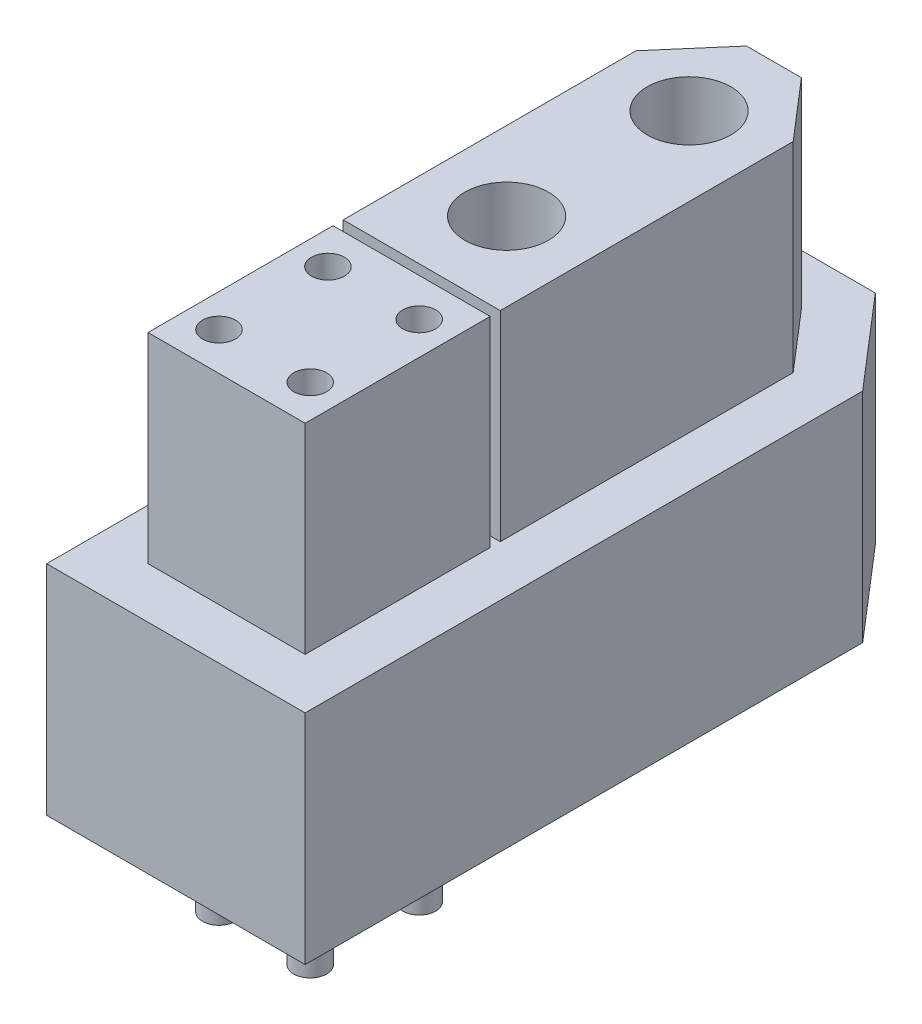
ISO-10303-21;
HEADER;
FILE_DESCRIPTION(('STEP AP214'),'2;1');
FILE_NAME('part.step','',(''),(''),'','','');
FILE_SCHEMA(('AUTOMOTIVE_DESIGN { 1 0 10303 214 1 1 1 1 }'));
ENDSEC;
DATA;
#1=APPLICATION_CONTEXT('core data for automotive mechanical design processes');
#2=APPLICATION_PROTOCOL_DEFINITION('international standard','automotive_design',2000,#1);
#3=PRODUCT_CONTEXT('',#1,'mechanical');
#4=PRODUCT('Part','Part','',(#3));
#5=PRODUCT_RELATED_PRODUCT_CATEGORY('part','',(#4));
#6=PRODUCT_DEFINITION_FORMATION('','',#4);
#7=PRODUCT_DEFINITION_CONTEXT('part definition',#1,'design');
#8=PRODUCT_DEFINITION('design','',#6,#7);
#9=PRODUCT_DEFINITION_SHAPE('','',#8);
#10=(LENGTH_UNIT() NAMED_UNIT(*) SI_UNIT(.MILLI.,.METRE.));
#11=(NAMED_UNIT(*) PLANE_ANGLE_UNIT() SI_UNIT($,.RADIAN.));
#12=(NAMED_UNIT(*) SI_UNIT($,.STERADIAN.) SOLID_ANGLE_UNIT());
#13=UNCERTAINTY_MEASURE_WITH_UNIT(LENGTH_MEASURE(1.E-05),#10,'distance_accuracy_value','');
#14=(GEOMETRIC_REPRESENTATION_CONTEXT(3) GLOBAL_UNCERTAINTY_ASSIGNED_CONTEXT((#13)) GLOBAL_UNIT_ASSIGNED_CONTEXT((#10,
#11,#12)) REPRESENTATION_CONTEXT('',''));
#15=CARTESIAN_POINT('',(0.,0.,0.));
#16=DIRECTION('',(0.,0.,1.));
#17=DIRECTION('',(1.,0.,0.));
#18=AXIS2_PLACEMENT_3D('',#15,#16,#17);
#19=CARTESIAN_POINT('',(0.,8.6,0.));
#20=DIRECTION('',(0.,0.,-1.));
#21=DIRECTION('',(-1.,0.,0.));
#22=AXIS2_PLACEMENT_3D('',#19,#20,#21);
#23=PLANE('',#22);
#24=DIRECTION('',(1.,0.,0.));
#25=VECTOR('',#24,1.);
#26=CARTESIAN_POINT('',(0.,0.,0.));
#27=LINE('',#26,#25);
#28=CARTESIAN_POINT('',(0.,0.,0.));
#29=VERTEX_POINT('',#28);
#30=CARTESIAN_POINT('',(10.2,0.,0.));
#31=VERTEX_POINT('',#30);
#32=EDGE_CURVE('E268',#29,#31,#27,.T.);
#33=ORIENTED_EDGE('',*,*,#32,.T.);
#34=DIRECTION('',(0.,-1.,0.));
#35=VECTOR('',#34,1.);
#36=CARTESIAN_POINT('',(10.2,8.6,0.));
#37=LINE('',#36,#35);
#38=CARTESIAN_POINT('',(10.2,8.6,0.));
#39=VERTEX_POINT('',#38);
#40=EDGE_CURVE('E326',#39,#31,#37,.T.);
#41=ORIENTED_EDGE('',*,*,#40,.F.);
#42=DIRECTION('',(1.,0.,0.));
#43=VECTOR('',#42,1.);
#44=CARTESIAN_POINT('',(0.,8.6,0.));
#45=LINE('',#44,#43);
#46=CARTESIAN_POINT('',(0.,8.6,0.));
#47=VERTEX_POINT('',#46);
#48=EDGE_CURVE('E269',#47,#39,#45,.T.);
#49=ORIENTED_EDGE('',*,*,#48,.F.);
#50=DIRECTION('',(0.,-1.,0.));
#51=VECTOR('',#50,1.);
#52=CARTESIAN_POINT('',(0.,8.6,0.));
#53=LINE('',#52,#51);
#54=EDGE_CURVE('E289',#47,#29,#53,.T.);
#55=ORIENTED_EDGE('',*,*,#54,.T.);
#56=EDGE_LOOP('',(#33,#41,#49,#55));
#57=FACE_BOUND('',#56,.T.);
#58=ADVANCED_FACE('F39',(#57),#23,.F.);
#59=CARTESIAN_POINT('',(10.2,8.6,0.));
#60=DIRECTION('',(-1.,0.,0.));
#61=DIRECTION('',(0.,0.,1.));
#62=AXIS2_PLACEMENT_3D('',#59,#60,#61);
#63=PLANE('',#62);
#64=DIRECTION('',(0.,0.,-1.));
#65=VECTOR('',#64,1.);
#66=CARTESIAN_POINT('',(10.2,0.,0.));
#67=LINE('',#66,#65);
#68=CARTESIAN_POINT('',(10.2,0.,-22.));
#69=VERTEX_POINT('',#68);
#70=EDGE_CURVE('E293',#31,#69,#67,.T.);
#71=ORIENTED_EDGE('',*,*,#70,.T.);
#72=DIRECTION('',(0.,-1.,0.));
#73=VECTOR('',#72,1.);
#74=CARTESIAN_POINT('',(10.2,8.6,-22.));
#75=LINE('',#74,#73);
#76=CARTESIAN_POINT('',(10.2,8.6,-22.));
#77=VERTEX_POINT('',#76);
#78=EDGE_CURVE('E322',#77,#69,#75,.T.);
#79=ORIENTED_EDGE('',*,*,#78,.F.);
#80=DIRECTION('',(0.,0.,-1.));
#81=VECTOR('',#80,1.);
#82=CARTESIAN_POINT('',(10.2,8.6,0.));
#83=LINE('',#82,#81);
#84=EDGE_CURVE('E273',#39,#77,#83,.T.);
#85=ORIENTED_EDGE('',*,*,#84,.F.);
#86=ORIENTED_EDGE('',*,*,#40,.T.);
#87=EDGE_LOOP('',(#71,#79,#85,#86));
#88=FACE_BOUND('',#87,.T.);
#89=ADVANCED_FACE('F441',(#88),#63,.F.);
#90=CARTESIAN_POINT('',(10.2,8.6,-22.));
#91=DIRECTION('',(-0.757768802353406,0.,0.652523135359877));
#92=DIRECTION('',(0.652523135359877,0.,0.757768802353406));
#93=AXIS2_PLACEMENT_3D('',#90,#91,#92);
#94=PLANE('',#93);
#95=DIRECTION('',(-0.652523135359877,0.,-0.757768802353406));
#96=VECTOR('',#95,1.);
#97=CARTESIAN_POINT('',(10.2,0.,-22.));
#98=LINE('',#97,#96);
#99=CARTESIAN_POINT('',(7.1,0.,-25.6));
#100=VERTEX_POINT('',#99);
#101=EDGE_CURVE('E296',#69,#100,#98,.T.);
#102=ORIENTED_EDGE('',*,*,#101,.T.);
#103=DIRECTION('',(0.,-1.,0.));
#104=VECTOR('',#103,1.);
#105=CARTESIAN_POINT('',(7.1,8.6,-25.6));
#106=LINE('',#105,#104);
#107=CARTESIAN_POINT('',(7.1,8.6,-25.6));
#108=VERTEX_POINT('',#107);
#109=EDGE_CURVE('E318',#108,#100,#106,.T.);
#110=ORIENTED_EDGE('',*,*,#109,.F.);
#111=DIRECTION('',(-0.652523135359877,0.,-0.757768802353406));
#112=VECTOR('',#111,1.);
#113=CARTESIAN_POINT('',(10.2,8.6,-22.));
#114=LINE('',#113,#112);
#115=EDGE_CURVE('E277',#77,#108,#114,.T.);
#116=ORIENTED_EDGE('',*,*,#115,.F.);
#117=ORIENTED_EDGE('',*,*,#78,.T.);
#118=EDGE_LOOP('',(#102,#110,#116,#117));
#119=FACE_BOUND('',#118,.T.);
#120=ADVANCED_FACE('F446',(#119),#94,.F.);
#121=CARTESIAN_POINT('',(3.1,8.6,-25.6));
#122=DIRECTION('',(0.,0.,1.));
#123=DIRECTION('',(1.,0.,0.));
#124=AXIS2_PLACEMENT_3D('',#121,#122,#123);
#125=PLANE('',#124);
#126=DIRECTION('',(-1.,0.,0.));
#127=VECTOR('',#126,1.);
#128=CARTESIAN_POINT('',(3.1,0.,-25.6));
#129=LINE('',#128,#127);
#130=CARTESIAN_POINT('',(3.1,0.,-25.6));
#131=VERTEX_POINT('',#130);
#132=EDGE_CURVE('E299',#100,#131,#129,.T.);
#133=ORIENTED_EDGE('',*,*,#132,.T.);
#134=DIRECTION('',(0.,-1.,0.));
#135=VECTOR('',#134,1.);
#136=CARTESIAN_POINT('',(3.1,8.6,-25.6));
#137=LINE('',#136,#135);
#138=CARTESIAN_POINT('',(3.1,8.6,-25.6));
#139=VERTEX_POINT('',#138);
#140=EDGE_CURVE('E314',#139,#131,#137,.T.);
#141=ORIENTED_EDGE('',*,*,#140,.F.);
#142=DIRECTION('',(-1.,0.,0.));
#143=VECTOR('',#142,1.);
#144=CARTESIAN_POINT('',(3.1,8.6,-25.6));
#145=LINE('',#144,#143);
#146=EDGE_CURVE('E280',#108,#139,#145,.T.);
#147=ORIENTED_EDGE('',*,*,#146,.F.);
#148=ORIENTED_EDGE('',*,*,#109,.T.);
#149=EDGE_LOOP('',(#133,#141,#147,#148));
#150=FACE_BOUND('',#149,.T.);
#151=ADVANCED_FACE('F470',(#150),#125,.F.);
#152=CARTESIAN_POINT('',(0.,8.6,-22.));
#153=DIRECTION('',(0.757768802353406,0.,0.652523135359877));
#154=DIRECTION('',(0.652523135359877,0.,-0.757768802353406));
#155=AXIS2_PLACEMENT_3D('',#152,#153,#154);
#156=PLANE('',#155);
#157=DIRECTION('',(-0.652523135359877,0.,0.757768802353406));
#158=VECTOR('',#157,1.);
#159=CARTESIAN_POINT('',(0.,0.,-22.));
#160=LINE('',#159,#158);
#161=CARTESIAN_POINT('',(0.,0.,-22.));
#162=VERTEX_POINT('',#161);
#163=EDGE_CURVE('E302',#131,#162,#160,.T.);
#164=ORIENTED_EDGE('',*,*,#163,.T.);
#165=DIRECTION('',(0.,-1.,0.));
#166=VECTOR('',#165,1.);
#167=CARTESIAN_POINT('',(0.,8.6,-22.));
#168=LINE('',#167,#166);
#169=CARTESIAN_POINT('',(0.,8.6,-22.));
#170=VERTEX_POINT('',#169);
#171=EDGE_CURVE('E310',#170,#162,#168,.T.);
#172=ORIENTED_EDGE('',*,*,#171,.F.);
#173=DIRECTION('',(-0.652523135359877,0.,0.757768802353406));
#174=VECTOR('',#173,1.);
#175=CARTESIAN_POINT('',(0.,8.6,-22.));
#176=LINE('',#175,#174);
#177=EDGE_CURVE('E283',#139,#170,#176,.T.);
#178=ORIENTED_EDGE('',*,*,#177,.F.);
#179=ORIENTED_EDGE('',*,*,#140,.T.);
#180=EDGE_LOOP('',(#164,#172,#178,#179));
#181=FACE_BOUND('',#180,.T.);
#182=ADVANCED_FACE('F467',(#181),#156,.F.);
#183=CARTESIAN_POINT('',(0.,8.6,0.));
#184=DIRECTION('',(1.,0.,0.));
#185=DIRECTION('',(0.,0.,-1.));
#186=AXIS2_PLACEMENT_3D('',#183,#184,#185);
#187=PLANE('',#186);
#188=DIRECTION('',(0.,0.,1.));
#189=VECTOR('',#188,1.);
#190=CARTESIAN_POINT('',(0.,0.,0.));
#191=LINE('',#190,#189);
#192=EDGE_CURVE('E274',#162,#29,#191,.T.);
#193=ORIENTED_EDGE('',*,*,#192,.T.);
#194=ORIENTED_EDGE('',*,*,#54,.F.);
#195=DIRECTION('',(0.,0.,1.));
#196=VECTOR('',#195,1.);
#197=CARTESIAN_POINT('',(0.,8.6,0.));
#198=LINE('',#197,#196);
#199=EDGE_CURVE('E286',#170,#47,#198,.T.);
#200=ORIENTED_EDGE('',*,*,#199,.F.);
#201=ORIENTED_EDGE('',*,*,#171,.T.);
#202=EDGE_LOOP('',(#193,#194,#200,#201));
#203=FACE_BOUND('',#202,.T.);
#204=ADVANCED_FACE('F465',(#203),#187,.F.);
#205=CARTESIAN_POINT('',(0.,8.6,0.));
#206=DIRECTION('',(0.,1.,0.));
#207=DIRECTION('',(0.,0.,1.));
#208=AXIS2_PLACEMENT_3D('',#205,#206,#207);
#209=PLANE('',#208);
#210=DIRECTION('',(1.,0.,0.));
#211=VECTOR('',#210,1.);
#212=CARTESIAN_POINT('',(2.,8.6,-2.));
#213=LINE('',#212,#211);
#214=CARTESIAN_POINT('',(2.,8.6,-2.));
#215=VERTEX_POINT('',#214);
#216=CARTESIAN_POINT('',(8.2,8.6,-2.));
#217=VERTEX_POINT('',#216);
#218=EDGE_CURVE('E411',#215,#217,#213,.T.);
#219=ORIENTED_EDGE('',*,*,#218,.F.);
#220=DIRECTION('',(0.,0.,1.));
#221=VECTOR('',#220,1.);
#222=CARTESIAN_POINT('',(2.,8.6,-9.3));
#223=LINE('',#222,#221);
#224=CARTESIAN_POINT('',(2.,8.6,-9.3));
#225=VERTEX_POINT('',#224);
#226=EDGE_CURVE('E180',#225,#215,#223,.T.);
#227=ORIENTED_EDGE('',*,*,#226,.F.);
#228=DIRECTION('',(-1.,0.,0.));
#229=VECTOR('',#228,1.);
#230=CARTESIAN_POINT('',(2.,8.6,-9.3));
#231=LINE('',#230,#229);
#232=CARTESIAN_POINT('',(8.2,8.6,-9.3));
#233=VERTEX_POINT('',#232);
#234=EDGE_CURVE('E176',#233,#225,#231,.T.);
#235=ORIENTED_EDGE('',*,*,#234,.F.);
#236=DIRECTION('',(0.,0.,-1.));
#237=VECTOR('',#236,1.);
#238=CARTESIAN_POINT('',(8.2,8.6,-2.));
#239=LINE('',#238,#237);
#240=EDGE_CURVE('E414',#217,#233,#239,.T.);
#241=ORIENTED_EDGE('',*,*,#240,.F.);
#242=EDGE_LOOP('',(#219,#227,#235,#241));
#243=FACE_BOUND('',#242,.T.);
#244=DIRECTION('',(0.,0.,1.));
#245=VECTOR('',#244,1.);
#246=CARTESIAN_POINT('',(2.,8.6,-21.2575552205885));
#247=LINE('',#246,#245);
#248=CARTESIAN_POINT('',(2.,8.6,-21.2575552205885));
#249=VERTEX_POINT('',#248);
#250=CARTESIAN_POINT('',(2.,8.6,-9.7));
#251=VERTEX_POINT('',#250);
#252=EDGE_CURVE('E64',#249,#251,#247,.T.);
#253=ORIENTED_EDGE('',*,*,#252,.F.);
#254=DIRECTION('',(-0.652523135359878,0.,0.757768802353406));
#255=VECTOR('',#254,1.);
#256=CARTESIAN_POINT('',(4.01710522671549,8.6,-23.6));
#257=LINE('',#256,#255);
#258=CARTESIAN_POINT('',(4.01710522671549,8.6,-23.6));
#259=VERTEX_POINT('',#258);
#260=EDGE_CURVE('E209',#259,#249,#257,.T.);
#261=ORIENTED_EDGE('',*,*,#260,.F.);
#262=DIRECTION('',(-1.,0.,0.));
#263=VECTOR('',#262,1.);
#264=CARTESIAN_POINT('',(6.18289477328451,8.6,-23.6));
#265=LINE('',#264,#263);
#266=CARTESIAN_POINT('',(6.18289477328451,8.6,-23.6));
#267=VERTEX_POINT('',#266);
#268=EDGE_CURVE('E239',#267,#259,#265,.T.);
#269=ORIENTED_EDGE('',*,*,#268,.F.);
#270=DIRECTION('',(-0.652523135359878,0.,-0.757768802353406));
#271=VECTOR('',#270,1.);
#272=CARTESIAN_POINT('',(8.2,8.6,-21.2575552205885));
#273=LINE('',#272,#271);
#274=CARTESIAN_POINT('',(8.2,8.6,-21.2575552205885));
#275=VERTEX_POINT('',#274);
#276=EDGE_CURVE('E235',#275,#267,#273,.T.);
#277=ORIENTED_EDGE('',*,*,#276,.F.);
#278=DIRECTION('',(0.,0.,-1.));
#279=VECTOR('',#278,1.);
#280=CARTESIAN_POINT('',(8.2,8.6,-9.7));
#281=LINE('',#280,#279);
#282=CARTESIAN_POINT('',(8.2,8.6,-9.7));
#283=VERTEX_POINT('',#282);
#284=EDGE_CURVE('E231',#283,#275,#281,.T.);
#285=ORIENTED_EDGE('',*,*,#284,.F.);
#286=DIRECTION('',(1.,0.,0.));
#287=VECTOR('',#286,1.);
#288=CARTESIAN_POINT('',(2.,8.6,-9.7));
#289=LINE('',#288,#287);
#290=EDGE_CURVE('E227',#251,#283,#289,.T.);
#291=ORIENTED_EDGE('',*,*,#290,.F.);
#292=EDGE_LOOP('',(#253,#261,#269,#277,#285,#291));
#293=FACE_BOUND('',#292,.T.);
#294=ORIENTED_EDGE('',*,*,#48,.T.);
#295=ORIENTED_EDGE('',*,*,#84,.T.);
#296=ORIENTED_EDGE('',*,*,#115,.T.);
#297=ORIENTED_EDGE('',*,*,#146,.T.);
#298=ORIENTED_EDGE('',*,*,#177,.T.);
#299=ORIENTED_EDGE('',*,*,#199,.T.);
#300=EDGE_LOOP('',(#294,#295,#296,#297,#298,#299));
#301=FACE_BOUND('',#300,.T.);
#302=ADVANCED_FACE('F423',(#243,#293,#301),#209,.T.);
#303=CARTESIAN_POINT('',(0.,0.,0.));
#304=DIRECTION('',(0.,1.,0.));
#305=DIRECTION('',(0.,0.,1.));
#306=AXIS2_PLACEMENT_3D('',#303,#304,#305);
#307=PLANE('',#306);
#308=CARTESIAN_POINT('',(3.3,0.,-3.5));
#309=DIRECTION('',(0.,1.,0.));
#310=DIRECTION('',(0.,0.,1.));
#311=AXIS2_PLACEMENT_3D('',#308,#309,#310);
#312=CIRCLE('',#311,0.65);
#313=CARTESIAN_POINT('',(3.3,0.,-2.85));
#314=VERTEX_POINT('',#313);
#315=EDGE_CURVE('E42',#314,#314,#312,.T.);
#316=ORIENTED_EDGE('',*,*,#315,.T.);
#317=EDGE_LOOP('',(#316));
#318=FACE_BOUND('',#317,.T.);
#319=CARTESIAN_POINT('',(6.9,0.,-3.5));
#320=DIRECTION('',(0.,1.,0.));
#321=DIRECTION('',(0.,0.,1.));
#322=AXIS2_PLACEMENT_3D('',#319,#320,#321);
#323=CIRCLE('',#322,0.650000000000001);
#324=CARTESIAN_POINT('',(6.9,0.,-2.85));
#325=VERTEX_POINT('',#324);
#326=EDGE_CURVE('E361',#325,#325,#323,.T.);
#327=ORIENTED_EDGE('',*,*,#326,.T.);
#328=EDGE_LOOP('',(#327));
#329=FACE_BOUND('',#328,.T.);
#330=CARTESIAN_POINT('',(6.9,0.,-7.8));
#331=DIRECTION('',(0.,1.,0.));
#332=DIRECTION('',(0.,0.,1.));
#333=AXIS2_PLACEMENT_3D('',#330,#331,#332);
#334=CIRCLE('',#333,0.65);
#335=CARTESIAN_POINT('',(6.9,0.,-7.15));
#336=VERTEX_POINT('',#335);
#337=EDGE_CURVE('E357',#336,#336,#334,.T.);
#338=ORIENTED_EDGE('',*,*,#337,.T.);
#339=EDGE_LOOP('',(#338));
#340=FACE_BOUND('',#339,.T.);
#341=CARTESIAN_POINT('',(3.3,0.,-7.8));
#342=DIRECTION('',(0.,1.,0.));
#343=DIRECTION('',(0.,0.,1.));
#344=AXIS2_PLACEMENT_3D('',#341,#342,#343);
#345=CIRCLE('',#344,0.65);
#346=CARTESIAN_POINT('',(3.3,0.,-7.15));
#347=VERTEX_POINT('',#346);
#348=EDGE_CURVE('E352',#347,#347,#345,.T.);
#349=ORIENTED_EDGE('',*,*,#348,.T.);
#350=EDGE_LOOP('',(#349));
#351=FACE_BOUND('',#350,.T.);
#352=CARTESIAN_POINT('',(5.1,0.,-13.05));
#353=DIRECTION('',(0.,1.,0.));
#354=DIRECTION('',(0.,0.,1.));
#355=AXIS2_PLACEMENT_3D('',#352,#353,#354);
#356=CIRCLE('',#355,1.65);
#357=CARTESIAN_POINT('',(5.1,0.,-11.4));
#358=VERTEX_POINT('',#357);
#359=EDGE_CURVE('E347',#358,#358,#356,.T.);
#360=ORIENTED_EDGE('',*,*,#359,.T.);
#361=EDGE_LOOP('',(#360));
#362=FACE_BOUND('',#361,.T.);
#363=CARTESIAN_POINT('',(5.1,0.,-20.25));
#364=DIRECTION('',(0.,1.,0.));
#365=DIRECTION('',(0.,0.,1.));
#366=AXIS2_PLACEMENT_3D('',#363,#364,#365);
#367=CIRCLE('',#366,1.65);
#368=CARTESIAN_POINT('',(5.1,0.,-18.6));
#369=VERTEX_POINT('',#368);
#370=EDGE_CURVE('E341',#369,#369,#367,.T.);
#371=ORIENTED_EDGE('',*,*,#370,.T.);
#372=EDGE_LOOP('',(#371));
#373=FACE_BOUND('',#372,.T.);
#374=ORIENTED_EDGE('',*,*,#32,.F.);
#375=ORIENTED_EDGE('',*,*,#192,.F.);
#376=ORIENTED_EDGE('',*,*,#163,.F.);
#377=ORIENTED_EDGE('',*,*,#132,.F.);
#378=ORIENTED_EDGE('',*,*,#101,.F.);
#379=ORIENTED_EDGE('',*,*,#70,.F.);
#380=EDGE_LOOP('',(#374,#375,#376,#377,#378,#379));
#381=FACE_BOUND('',#380,.T.);
#382=ADVANCED_FACE('F454',(#318,#329,#340,#351,#362,#373,#381),#307,.F.);
#383=CARTESIAN_POINT('',(0.,16.5,0.));
#384=DIRECTION('',(0.,1.,0.));
#385=DIRECTION('',(0.,0.,1.));
#386=AXIS2_PLACEMENT_3D('',#383,#384,#385);
#387=PLANE('',#386);
#388=CARTESIAN_POINT('',(5.1,16.5,-20.25));
#389=DIRECTION('',(0.,1.,0.));
#390=DIRECTION('',(0.,0.,1.));
#391=AXIS2_PLACEMENT_3D('',#388,#389,#390);
#392=CIRCLE('',#391,1.65);
#393=CARTESIAN_POINT('',(5.1,16.5,-18.6));
#394=VERTEX_POINT('',#393);
#395=EDGE_CURVE('E197',#394,#394,#392,.T.);
#396=ORIENTED_EDGE('',*,*,#395,.F.);
#397=EDGE_LOOP('',(#396));
#398=FACE_BOUND('',#397,.T.);
#399=DIRECTION('',(0.,0.,1.));
#400=VECTOR('',#399,1.);
#401=CARTESIAN_POINT('',(2.,16.5,-21.2575552205885));
#402=LINE('',#401,#400);
#403=CARTESIAN_POINT('',(2.,16.5,-21.2575552205885));
#404=VERTEX_POINT('',#403);
#405=CARTESIAN_POINT('',(2.,16.5,-9.7));
#406=VERTEX_POINT('',#405);
#407=EDGE_CURVE('E204',#404,#406,#402,.T.);
#408=ORIENTED_EDGE('',*,*,#407,.T.);
#409=DIRECTION('',(1.,0.,0.));
#410=VECTOR('',#409,1.);
#411=CARTESIAN_POINT('',(2.,16.5,-9.7));
#412=LINE('',#411,#410);
#413=CARTESIAN_POINT('',(8.2,16.5,-9.7));
#414=VERTEX_POINT('',#413);
#415=EDGE_CURVE('E208',#406,#414,#412,.T.);
#416=ORIENTED_EDGE('',*,*,#415,.T.);
#417=DIRECTION('',(0.,0.,-1.));
#418=VECTOR('',#417,1.);
#419=CARTESIAN_POINT('',(8.2,16.5,-9.7));
#420=LINE('',#419,#418);
#421=CARTESIAN_POINT('',(8.2,16.5,-21.2575552205885));
#422=VERTEX_POINT('',#421);
#423=EDGE_CURVE('E212',#414,#422,#420,.T.);
#424=ORIENTED_EDGE('',*,*,#423,.T.);
#425=DIRECTION('',(-0.652523135359878,0.,-0.757768802353406));
#426=VECTOR('',#425,1.);
#427=CARTESIAN_POINT('',(8.2,16.5,-21.2575552205885));
#428=LINE('',#427,#426);
#429=CARTESIAN_POINT('',(6.18289477328451,16.5,-23.6));
#430=VERTEX_POINT('',#429);
#431=EDGE_CURVE('E215',#422,#430,#428,.T.);
#432=ORIENTED_EDGE('',*,*,#431,.T.);
#433=DIRECTION('',(-1.,0.,0.));
#434=VECTOR('',#433,1.);
#435=CARTESIAN_POINT('',(6.18289477328451,16.5,-23.6));
#436=LINE('',#435,#434);
#437=CARTESIAN_POINT('',(4.01710522671549,16.5,-23.6));
#438=VERTEX_POINT('',#437);
#439=EDGE_CURVE('E218',#430,#438,#436,.T.);
#440=ORIENTED_EDGE('',*,*,#439,.T.);
#441=DIRECTION('',(-0.652523135359878,0.,0.757768802353406));
#442=VECTOR('',#441,1.);
#443=CARTESIAN_POINT('',(4.01710522671549,16.5,-23.6));
#444=LINE('',#443,#442);
#445=EDGE_CURVE('E221',#438,#404,#444,.T.);
#446=ORIENTED_EDGE('',*,*,#445,.T.);
#447=EDGE_LOOP('',(#408,#416,#424,#432,#440,#446));
#448=FACE_BOUND('',#447,.T.);
#449=CARTESIAN_POINT('',(5.1,16.5,-13.05));
#450=DIRECTION('',(0.,1.,0.));
#451=DIRECTION('',(0.,0.,1.));
#452=AXIS2_PLACEMENT_3D('',#449,#450,#451);
#453=CIRCLE('',#452,1.65);
#454=CARTESIAN_POINT('',(5.1,16.5,-11.4));
#455=VERTEX_POINT('',#454);
#456=EDGE_CURVE('E188',#455,#455,#453,.T.);
#457=ORIENTED_EDGE('',*,*,#456,.F.);
#458=EDGE_LOOP('',(#457));
#459=FACE_BOUND('',#458,.T.);
#460=ADVANCED_FACE('F487',(#398,#448,#459),#387,.T.);
#461=CARTESIAN_POINT('',(2.,16.5,-21.2575552205885));
#462=DIRECTION('',(1.,0.,0.));
#463=DIRECTION('',(0.,0.,-1.));
#464=AXIS2_PLACEMENT_3D('',#461,#462,#463);
#465=PLANE('',#464);
#466=ORIENTED_EDGE('',*,*,#252,.T.);
#467=DIRECTION('',(0.,-1.,0.));
#468=VECTOR('',#467,1.);
#469=CARTESIAN_POINT('',(2.,16.5,-9.7));
#470=LINE('',#469,#468);
#471=EDGE_CURVE('E264',#406,#251,#470,.T.);
#472=ORIENTED_EDGE('',*,*,#471,.F.);
#473=ORIENTED_EDGE('',*,*,#407,.F.);
#474=DIRECTION('',(0.,-1.,0.));
#475=VECTOR('',#474,1.);
#476=CARTESIAN_POINT('',(2.,16.5,-21.2575552205885));
#477=LINE('',#476,#475);
#478=EDGE_CURVE('E224',#404,#249,#477,.T.);
#479=ORIENTED_EDGE('',*,*,#478,.T.);
#480=EDGE_LOOP('',(#466,#472,#473,#479));
#481=FACE_BOUND('',#480,.T.);
#482=ADVANCED_FACE('F493',(#481),#465,.F.);
#483=CARTESIAN_POINT('',(2.,16.5,-9.7));
#484=DIRECTION('',(0.,0.,-1.));
#485=DIRECTION('',(-1.,0.,0.));
#486=AXIS2_PLACEMENT_3D('',#483,#484,#485);
#487=PLANE('',#486);
#488=ORIENTED_EDGE('',*,*,#290,.T.);
#489=DIRECTION('',(0.,-1.,0.));
#490=VECTOR('',#489,1.);
#491=CARTESIAN_POINT('',(8.2,16.5,-9.7));
#492=LINE('',#491,#490);
#493=EDGE_CURVE('E260',#414,#283,#492,.T.);
#494=ORIENTED_EDGE('',*,*,#493,.F.);
#495=ORIENTED_EDGE('',*,*,#415,.F.);
#496=ORIENTED_EDGE('',*,*,#471,.T.);
#497=EDGE_LOOP('',(#488,#494,#495,#496));
#498=FACE_BOUND('',#497,.T.);
#499=ADVANCED_FACE('F496',(#498),#487,.F.);
#500=CARTESIAN_POINT('',(8.2,16.5,-9.7));
#501=DIRECTION('',(-1.,0.,0.));
#502=DIRECTION('',(0.,0.,1.));
#503=AXIS2_PLACEMENT_3D('',#500,#501,#502);
#504=PLANE('',#503);
#505=ORIENTED_EDGE('',*,*,#284,.T.);
#506=DIRECTION('',(0.,-1.,0.));
#507=VECTOR('',#506,1.);
#508=CARTESIAN_POINT('',(8.2,16.5,-21.2575552205885));
#509=LINE('',#508,#507);
#510=EDGE_CURVE('E256',#422,#275,#509,.T.);
#511=ORIENTED_EDGE('',*,*,#510,.F.);
#512=ORIENTED_EDGE('',*,*,#423,.F.);
#513=ORIENTED_EDGE('',*,*,#493,.T.);
#514=EDGE_LOOP('',(#505,#511,#512,#513));
#515=FACE_BOUND('',#514,.T.);
#516=ADVANCED_FACE('F500',(#515),#504,.F.);
#517=CARTESIAN_POINT('',(8.2,16.5,-21.2575552205885));
#518=DIRECTION('',(-0.757768802353406,0.,0.652523135359877));
#519=DIRECTION('',(0.652523135359877,0.,0.757768802353406));
#520=AXIS2_PLACEMENT_3D('',#517,#518,#519);
#521=PLANE('',#520);
#522=ORIENTED_EDGE('',*,*,#276,.T.);
#523=DIRECTION('',(0.,-1.,0.));
#524=VECTOR('',#523,1.);
#525=CARTESIAN_POINT('',(6.18289477328451,16.5,-23.6));
#526=LINE('',#525,#524);
#527=EDGE_CURVE('E252',#430,#267,#526,.T.);
#528=ORIENTED_EDGE('',*,*,#527,.F.);
#529=ORIENTED_EDGE('',*,*,#431,.F.);
#530=ORIENTED_EDGE('',*,*,#510,.T.);
#531=EDGE_LOOP('',(#522,#528,#529,#530));
#532=FACE_BOUND('',#531,.T.);
#533=ADVANCED_FACE('F504',(#532),#521,.F.);
#534=CARTESIAN_POINT('',(6.18289477328451,16.5,-23.6));
#535=DIRECTION('',(0.,0.,1.));
#536=DIRECTION('',(1.,0.,0.));
#537=AXIS2_PLACEMENT_3D('',#534,#535,#536);
#538=PLANE('',#537);
#539=ORIENTED_EDGE('',*,*,#268,.T.);
#540=DIRECTION('',(0.,-1.,0.));
#541=VECTOR('',#540,1.);
#542=CARTESIAN_POINT('',(4.01710522671549,16.5,-23.6));
#543=LINE('',#542,#541);
#544=EDGE_CURVE('E248',#438,#259,#543,.T.);
#545=ORIENTED_EDGE('',*,*,#544,.F.);
#546=ORIENTED_EDGE('',*,*,#439,.F.);
#547=ORIENTED_EDGE('',*,*,#527,.T.);
#548=EDGE_LOOP('',(#539,#545,#546,#547));
#549=FACE_BOUND('',#548,.T.);
#550=ADVANCED_FACE('F508',(#549),#538,.F.);
#551=CARTESIAN_POINT('',(4.01710522671549,16.5,-23.6));
#552=DIRECTION('',(0.757768802353406,0.,0.652523135359877));
#553=DIRECTION('',(0.652523135359877,0.,-0.757768802353406));
#554=AXIS2_PLACEMENT_3D('',#551,#552,#553);
#555=PLANE('',#554);
#556=ORIENTED_EDGE('',*,*,#260,.T.);
#557=ORIENTED_EDGE('',*,*,#478,.F.);
#558=ORIENTED_EDGE('',*,*,#445,.F.);
#559=ORIENTED_EDGE('',*,*,#544,.T.);
#560=EDGE_LOOP('',(#556,#557,#558,#559));
#561=FACE_BOUND('',#560,.T.);
#562=ADVANCED_FACE('F512',(#561),#555,.F.);
#563=CARTESIAN_POINT('',(5.1,16.5,-20.25));
#564=DIRECTION('',(0.,-1.,0.));
#565=DIRECTION('',(0.,0.,-1.));
#566=AXIS2_PLACEMENT_3D('',#563,#564,#565);
#567=CYLINDRICAL_SURFACE('',#566,1.65);
#568=ORIENTED_EDGE('',*,*,#395,.T.);
#569=EDGE_LOOP('',(#568));
#570=FACE_BOUND('',#569,.T.);
#571=CARTESIAN_POINT('',(5.1,8.6,-20.25));
#572=DIRECTION('',(0.,1.,0.));
#573=DIRECTION('',(0.,0.,1.));
#574=AXIS2_PLACEMENT_3D('',#571,#572,#573);
#575=CIRCLE('',#574,1.65);
#576=CARTESIAN_POINT('',(5.1,8.6,-18.6));
#577=VERTEX_POINT('',#576);
#578=EDGE_CURVE('E195',#577,#577,#575,.T.);
#579=ORIENTED_EDGE('',*,*,#578,.F.);
#580=EDGE_LOOP('',(#579));
#581=FACE_BOUND('',#580,.T.);
#582=ADVANCED_FACE('F516',(#570,#581),#567,.F.);
#583=CARTESIAN_POINT('',(5.1,16.5,-13.05));
#584=DIRECTION('',(0.,-1.,0.));
#585=DIRECTION('',(0.,0.,-1.));
#586=AXIS2_PLACEMENT_3D('',#583,#584,#585);
#587=CYLINDRICAL_SURFACE('',#586,1.65);
#588=ORIENTED_EDGE('',*,*,#456,.T.);
#589=EDGE_LOOP('',(#588));
#590=FACE_BOUND('',#589,.T.);
#591=CARTESIAN_POINT('',(5.1,8.6,-13.05));
#592=DIRECTION('',(0.,1.,0.));
#593=DIRECTION('',(0.,0.,1.));
#594=AXIS2_PLACEMENT_3D('',#591,#592,#593);
#595=CIRCLE('',#594,1.65);
#596=CARTESIAN_POINT('',(5.1,8.6,-11.4));
#597=VERTEX_POINT('',#596);
#598=EDGE_CURVE('E183',#597,#597,#595,.T.);
#599=ORIENTED_EDGE('',*,*,#598,.F.);
#600=EDGE_LOOP('',(#599));
#601=FACE_BOUND('',#600,.T.);
#602=ADVANCED_FACE('F523',(#590,#601),#587,.F.);
#603=ORIENTED_EDGE('',*,*,#578,.T.);
#604=EDGE_LOOP('',(#603));
#605=FACE_BOUND('',#604,.T.);
#606=ADVANCED_FACE('F527',(#605),#209,.T.);
#607=ORIENTED_EDGE('',*,*,#598,.T.);
#608=EDGE_LOOP('',(#607));
#609=FACE_BOUND('',#608,.T.);
#610=ADVANCED_FACE('F492',(#609),#209,.T.);
#611=CARTESIAN_POINT('',(0.,16.5,0.));
#612=DIRECTION('',(0.,1.,0.));
#613=DIRECTION('',(0.,0.,1.));
#614=AXIS2_PLACEMENT_3D('',#611,#612,#613);
#615=PLANE('',#614);
#616=CARTESIAN_POINT('',(6.9,16.5,-3.5));
#617=DIRECTION('',(0.,1.,0.));
#618=DIRECTION('',(0.,0.,1.));
#619=AXIS2_PLACEMENT_3D('',#616,#617,#618);
#620=CIRCLE('',#619,0.650000000000001);
#621=CARTESIAN_POINT('',(6.9,16.5,-2.85));
#622=VERTEX_POINT('',#621);
#623=EDGE_CURVE('E392',#622,#622,#620,.T.);
#624=ORIENTED_EDGE('',*,*,#623,.F.);
#625=EDGE_LOOP('',(#624));
#626=FACE_BOUND('',#625,.T.);
#627=CARTESIAN_POINT('',(3.3,16.5,-7.8));
#628=DIRECTION('',(0.,1.,0.));
#629=DIRECTION('',(0.,0.,1.));
#630=AXIS2_PLACEMENT_3D('',#627,#628,#629);
#631=CIRCLE('',#630,0.65);
#632=CARTESIAN_POINT('',(3.3,16.5,-7.15));
#633=VERTEX_POINT('',#632);
#634=EDGE_CURVE('E400',#633,#633,#631,.T.);
#635=ORIENTED_EDGE('',*,*,#634,.F.);
#636=EDGE_LOOP('',(#635));
#637=FACE_BOUND('',#636,.T.);
#638=DIRECTION('',(0.,0.,1.));
#639=VECTOR('',#638,1.);
#640=CARTESIAN_POINT('',(2.,16.5,-9.3));
#641=LINE('',#640,#639);
#642=CARTESIAN_POINT('',(2.,16.5,-9.3));
#643=VERTEX_POINT('',#642);
#644=CARTESIAN_POINT('',(2.,16.5,-2.));
#645=VERTEX_POINT('',#644);
#646=EDGE_CURVE('E166',#643,#645,#641,.T.);
#647=ORIENTED_EDGE('',*,*,#646,.T.);
#648=DIRECTION('',(1.,0.,0.));
#649=VECTOR('',#648,1.);
#650=CARTESIAN_POINT('',(2.,16.5,-2.));
#651=LINE('',#650,#649);
#652=CARTESIAN_POINT('',(8.2,16.5,-2.));
#653=VERTEX_POINT('',#652);
#654=EDGE_CURVE('E154',#645,#653,#651,.T.);
#655=ORIENTED_EDGE('',*,*,#654,.T.);
#656=DIRECTION('',(0.,0.,-1.));
#657=VECTOR('',#656,1.);
#658=CARTESIAN_POINT('',(8.2,16.5,-2.));
#659=LINE('',#658,#657);
#660=CARTESIAN_POINT('',(8.2,16.5,-9.3));
#661=VERTEX_POINT('',#660);
#662=EDGE_CURVE('E165',#653,#661,#659,.T.);
#663=ORIENTED_EDGE('',*,*,#662,.T.);
#664=DIRECTION('',(-1.,0.,0.));
#665=VECTOR('',#664,1.);
#666=CARTESIAN_POINT('',(2.,16.5,-9.3));
#667=LINE('',#666,#665);
#668=EDGE_CURVE('E171',#661,#643,#667,.T.);
#669=ORIENTED_EDGE('',*,*,#668,.T.);
#670=EDGE_LOOP('',(#647,#655,#663,#669));
#671=FACE_BOUND('',#670,.T.);
#672=CARTESIAN_POINT('',(6.9,16.5,-7.8));
#673=DIRECTION('',(0.,1.,0.));
#674=DIRECTION('',(0.,0.,-1.));
#675=AXIS2_PLACEMENT_3D('',#672,#673,#674);
#676=CIRCLE('',#675,0.650000000000001);
#677=CARTESIAN_POINT('',(6.9,16.5,-8.45));
#678=VERTEX_POINT('',#677);
#679=EDGE_CURVE('E396',#678,#678,#676,.T.);
#680=ORIENTED_EDGE('',*,*,#679,.F.);
#681=EDGE_LOOP('',(#680));
#682=FACE_BOUND('',#681,.T.);
#683=CARTESIAN_POINT('',(3.3,16.5,-3.5));
#684=DIRECTION('',(0.,1.,0.));
#685=DIRECTION('',(0.,0.,-1.));
#686=AXIS2_PLACEMENT_3D('',#683,#684,#685);
#687=CIRCLE('',#686,0.65);
#688=CARTESIAN_POINT('',(3.3,16.5,-4.15));
#689=VERTEX_POINT('',#688);
#690=EDGE_CURVE('E345',#689,#689,#687,.T.);
#691=ORIENTED_EDGE('',*,*,#690,.F.);
#692=EDGE_LOOP('',(#691));
#693=FACE_BOUND('',#692,.T.);
#694=ADVANCED_FACE('F169',(#626,#637,#671,#682,#693),#615,.T.);
#695=CARTESIAN_POINT('',(2.,16.5,-9.3));
#696=DIRECTION('',(1.,0.,0.));
#697=DIRECTION('',(0.,0.,-1.));
#698=AXIS2_PLACEMENT_3D('',#695,#696,#697);
#699=PLANE('',#698);
#700=ORIENTED_EDGE('',*,*,#226,.T.);
#701=DIRECTION('',(0.,-1.,0.));
#702=VECTOR('',#701,1.);
#703=CARTESIAN_POINT('',(2.,16.5,-2.));
#704=LINE('',#703,#702);
#705=EDGE_CURVE('E158',#645,#215,#704,.T.);
#706=ORIENTED_EDGE('',*,*,#705,.F.);
#707=ORIENTED_EDGE('',*,*,#646,.F.);
#708=DIRECTION('',(0.,-1.,0.));
#709=VECTOR('',#708,1.);
#710=CARTESIAN_POINT('',(2.,16.5,-9.3));
#711=LINE('',#710,#709);
#712=EDGE_CURVE('E408',#643,#225,#711,.T.);
#713=ORIENTED_EDGE('',*,*,#712,.T.);
#714=EDGE_LOOP('',(#700,#706,#707,#713));
#715=FACE_BOUND('',#714,.T.);
#716=ADVANCED_FACE('F178',(#715),#699,.F.);
#717=CARTESIAN_POINT('',(2.,16.5,-2.));
#718=DIRECTION('',(0.,0.,-1.));
#719=DIRECTION('',(-1.,0.,0.));
#720=AXIS2_PLACEMENT_3D('',#717,#718,#719);
#721=PLANE('',#720);
#722=ORIENTED_EDGE('',*,*,#218,.T.);
#723=DIRECTION('',(0.,-1.,0.));
#724=VECTOR('',#723,1.);
#725=CARTESIAN_POINT('',(8.2,16.5,-2.));
#726=LINE('',#725,#724);
#727=EDGE_CURVE('E161',#653,#217,#726,.T.);
#728=ORIENTED_EDGE('',*,*,#727,.F.);
#729=ORIENTED_EDGE('',*,*,#654,.F.);
#730=ORIENTED_EDGE('',*,*,#705,.T.);
#731=EDGE_LOOP('',(#722,#728,#729,#730));
#732=FACE_BOUND('',#731,.T.);
#733=ADVANCED_FACE('F156',(#732),#721,.F.);
#734=CARTESIAN_POINT('',(8.2,16.5,-2.));
#735=DIRECTION('',(-1.,0.,0.));
#736=DIRECTION('',(0.,0.,1.));
#737=AXIS2_PLACEMENT_3D('',#734,#735,#736);
#738=PLANE('',#737);
#739=ORIENTED_EDGE('',*,*,#240,.T.);
#740=DIRECTION('',(0.,-1.,0.));
#741=VECTOR('',#740,1.);
#742=CARTESIAN_POINT('',(8.2,16.5,-9.3));
#743=LINE('',#742,#741);
#744=EDGE_CURVE('E56',#661,#233,#743,.T.);
#745=ORIENTED_EDGE('',*,*,#744,.F.);
#746=ORIENTED_EDGE('',*,*,#662,.F.);
#747=ORIENTED_EDGE('',*,*,#727,.T.);
#748=EDGE_LOOP('',(#739,#745,#746,#747));
#749=FACE_BOUND('',#748,.T.);
#750=ADVANCED_FACE('F426',(#749),#738,.F.);
#751=CARTESIAN_POINT('',(2.,16.5,-9.3));
#752=DIRECTION('',(0.,0.,1.));
#753=DIRECTION('',(1.,0.,0.));
#754=AXIS2_PLACEMENT_3D('',#751,#752,#753);
#755=PLANE('',#754);
#756=ORIENTED_EDGE('',*,*,#234,.T.);
#757=ORIENTED_EDGE('',*,*,#712,.F.);
#758=ORIENTED_EDGE('',*,*,#668,.F.);
#759=ORIENTED_EDGE('',*,*,#744,.T.);
#760=EDGE_LOOP('',(#756,#757,#758,#759));
#761=FACE_BOUND('',#760,.T.);
#762=ADVANCED_FACE('F427',(#761),#755,.F.);
#763=CARTESIAN_POINT('',(3.3,16.5,-7.8));
#764=DIRECTION('',(0.,-1.,0.));
#765=DIRECTION('',(0.,0.,-1.));
#766=AXIS2_PLACEMENT_3D('',#763,#764,#765);
#767=CYLINDRICAL_SURFACE('',#766,0.65);
#768=ORIENTED_EDGE('',*,*,#634,.T.);
#769=EDGE_LOOP('',(#768));
#770=FACE_BOUND('',#769,.T.);
#771=CARTESIAN_POINT('',(3.3,8.6,-7.8));
#772=DIRECTION('',(0.,1.,0.));
#773=DIRECTION('',(0.,0.,1.));
#774=AXIS2_PLACEMENT_3D('',#771,#772,#773);
#775=CIRCLE('',#774,0.65);
#776=CARTESIAN_POINT('',(3.3,8.6,-7.15));
#777=VERTEX_POINT('',#776);
#778=EDGE_CURVE('E11',#777,#777,#775,.F.);
#779=ORIENTED_EDGE('',*,*,#778,.T.);
#780=EDGE_LOOP('',(#779));
#781=FACE_BOUND('',#780,.T.);
#782=ADVANCED_FACE('F429',(#770,#781),#767,.F.);
#783=CARTESIAN_POINT('',(6.9,16.5,-7.8));
#784=DIRECTION('',(0.,-1.,0.));
#785=DIRECTION('',(0.,0.,-1.));
#786=AXIS2_PLACEMENT_3D('',#783,#784,#785);
#787=CYLINDRICAL_SURFACE('',#786,0.650000000000001);
#788=ORIENTED_EDGE('',*,*,#679,.T.);
#789=EDGE_LOOP('',(#788));
#790=FACE_BOUND('',#789,.T.);
#791=CARTESIAN_POINT('',(6.9,8.6,-7.8));
#792=DIRECTION('',(0.,1.,0.));
#793=DIRECTION('',(0.,0.,1.));
#794=AXIS2_PLACEMENT_3D('',#791,#792,#793);
#795=CIRCLE('',#794,0.650000000000001);
#796=CARTESIAN_POINT('',(6.9,8.6,-7.15));
#797=VERTEX_POINT('',#796);
#798=EDGE_CURVE('E48',#797,#797,#795,.F.);
#799=ORIENTED_EDGE('',*,*,#798,.T.);
#800=EDGE_LOOP('',(#799));
#801=FACE_BOUND('',#800,.T.);
#802=ADVANCED_FACE('F435',(#790,#801),#787,.F.);
#803=CARTESIAN_POINT('',(6.9,16.5,-3.5));
#804=DIRECTION('',(0.,-1.,0.));
#805=DIRECTION('',(0.,0.,-1.));
#806=AXIS2_PLACEMENT_3D('',#803,#804,#805);
#807=CYLINDRICAL_SURFACE('',#806,0.650000000000001);
#808=ORIENTED_EDGE('',*,*,#623,.T.);
#809=EDGE_LOOP('',(#808));
#810=FACE_BOUND('',#809,.T.);
#811=CARTESIAN_POINT('',(6.9,8.6,-3.5));
#812=DIRECTION('',(0.,1.,0.));
#813=DIRECTION('',(0.,0.,1.));
#814=AXIS2_PLACEMENT_3D('',#811,#812,#813);
#815=CIRCLE('',#814,0.650000000000001);
#816=CARTESIAN_POINT('',(6.9,8.6,-2.85));
#817=VERTEX_POINT('',#816);
#818=EDGE_CURVE('E334',#817,#817,#815,.F.);
#819=ORIENTED_EDGE('',*,*,#818,.T.);
#820=EDGE_LOOP('',(#819));
#821=FACE_BOUND('',#820,.T.);
#822=ADVANCED_FACE('F560',(#810,#821),#807,.F.);
#823=CARTESIAN_POINT('',(3.3,16.5,-3.5));
#824=DIRECTION('',(0.,-1.,0.));
#825=DIRECTION('',(0.,0.,-1.));
#826=AXIS2_PLACEMENT_3D('',#823,#824,#825);
#827=CYLINDRICAL_SURFACE('',#826,0.65);
#828=ORIENTED_EDGE('',*,*,#690,.T.);
#829=EDGE_LOOP('',(#828));
#830=FACE_BOUND('',#829,.T.);
#831=CARTESIAN_POINT('',(3.3,8.6,-3.5));
#832=DIRECTION('',(0.,1.,0.));
#833=DIRECTION('',(0.,0.,1.));
#834=AXIS2_PLACEMENT_3D('',#831,#832,#833);
#835=CIRCLE('',#834,0.65);
#836=CARTESIAN_POINT('',(3.3,8.6,-2.85));
#837=VERTEX_POINT('',#836);
#838=EDGE_CURVE('E330',#837,#837,#835,.F.);
#839=ORIENTED_EDGE('',*,*,#838,.T.);
#840=EDGE_LOOP('',(#839));
#841=FACE_BOUND('',#840,.T.);
#842=ADVANCED_FACE('F570',(#830,#841),#827,.F.);
#843=ORIENTED_EDGE('',*,*,#838,.F.);
#844=EDGE_LOOP('',(#843));
#845=FACE_BOUND('',#844,.T.);
#846=ADVANCED_FACE('F580',(#845),#209,.T.);
#847=ORIENTED_EDGE('',*,*,#818,.F.);
#848=EDGE_LOOP('',(#847));
#849=FACE_BOUND('',#848,.T.);
#850=ADVANCED_FACE('F591',(#849),#209,.T.);
#851=ORIENTED_EDGE('',*,*,#798,.F.);
#852=EDGE_LOOP('',(#851));
#853=FACE_BOUND('',#852,.T.);
#854=ADVANCED_FACE('F601',(#853),#209,.T.);
#855=ORIENTED_EDGE('',*,*,#778,.F.);
#856=EDGE_LOOP('',(#855));
#857=FACE_BOUND('',#856,.T.);
#858=ADVANCED_FACE('F491',(#857),#209,.T.);
#859=CARTESIAN_POINT('',(5.1,-3.4,-20.25));
#860=DIRECTION('',(0.,1.,0.));
#861=DIRECTION('',(0.,0.,1.));
#862=AXIS2_PLACEMENT_3D('',#859,#860,#861);
#863=CYLINDRICAL_SURFACE('',#862,1.65);
#864=CARTESIAN_POINT('',(5.1,-3.4,-20.25));
#865=DIRECTION('',(0.,1.,0.));
#866=DIRECTION('',(0.,0.,1.));
#867=AXIS2_PLACEMENT_3D('',#864,#865,#866);
#868=CIRCLE('',#867,1.65);
#869=CARTESIAN_POINT('',(5.1,-3.4,-18.6));
#870=VERTEX_POINT('',#869);
#871=EDGE_CURVE('E346',#870,#870,#868,.T.);
#872=ORIENTED_EDGE('',*,*,#871,.T.);
#873=EDGE_LOOP('',(#872));
#874=FACE_BOUND('',#873,.T.);
#875=ORIENTED_EDGE('',*,*,#370,.F.);
#876=EDGE_LOOP('',(#875));
#877=FACE_BOUND('',#876,.T.);
#878=ADVANCED_FACE('F617',(#874,#877),#863,.T.);
#879=CARTESIAN_POINT('',(5.1,-3.4,-20.25));
#880=DIRECTION('',(0.,1.,0.));
#881=DIRECTION('',(0.,0.,1.));
#882=AXIS2_PLACEMENT_3D('',#879,#880,#881);
#883=PLANE('',#882);
#884=ORIENTED_EDGE('',*,*,#871,.F.);
#885=EDGE_LOOP('',(#884));
#886=FACE_BOUND('',#885,.T.);
#887=ADVANCED_FACE('F631',(#886),#883,.F.);
#888=CARTESIAN_POINT('',(5.1,-3.4,-13.05));
#889=DIRECTION('',(0.,1.,0.));
#890=DIRECTION('',(0.,0.,1.));
#891=AXIS2_PLACEMENT_3D('',#888,#889,#890);
#892=CYLINDRICAL_SURFACE('',#891,1.65);
#893=CARTESIAN_POINT('',(5.1,-3.4,-13.05));
#894=DIRECTION('',(0.,1.,0.));
#895=DIRECTION('',(0.,0.,1.));
#896=AXIS2_PLACEMENT_3D('',#893,#894,#895);
#897=CIRCLE('',#896,1.65);
#898=CARTESIAN_POINT('',(5.1,-3.4,-11.4));
#899=VERTEX_POINT('',#898);
#900=EDGE_CURVE('E351',#899,#899,#897,.T.);
#901=ORIENTED_EDGE('',*,*,#900,.T.);
#902=EDGE_LOOP('',(#901));
#903=FACE_BOUND('',#902,.T.);
#904=ORIENTED_EDGE('',*,*,#359,.F.);
#905=EDGE_LOOP('',(#904));
#906=FACE_BOUND('',#905,.T.);
#907=ADVANCED_FACE('F641',(#903,#906),#892,.T.);
#908=CARTESIAN_POINT('',(5.1,-3.4,-13.05));
#909=DIRECTION('',(0.,1.,0.));
#910=DIRECTION('',(0.,0.,1.));
#911=AXIS2_PLACEMENT_3D('',#908,#909,#910);
#912=PLANE('',#911);
#913=ORIENTED_EDGE('',*,*,#900,.F.);
#914=EDGE_LOOP('',(#913));
#915=FACE_BOUND('',#914,.T.);
#916=ADVANCED_FACE('F651',(#915),#912,.F.);
#917=CARTESIAN_POINT('',(3.3,-3.4,-7.8));
#918=DIRECTION('',(0.,1.,0.));
#919=DIRECTION('',(0.,0.,1.));
#920=AXIS2_PLACEMENT_3D('',#917,#918,#919);
#921=CYLINDRICAL_SURFACE('',#920,0.65);
#922=CARTESIAN_POINT('',(3.3,-3.4,-7.8));
#923=DIRECTION('',(0.,1.,0.));
#924=DIRECTION('',(0.,0.,1.));
#925=AXIS2_PLACEMENT_3D('',#922,#923,#924);
#926=CIRCLE('',#925,0.65);
#927=CARTESIAN_POINT('',(3.3,-3.4,-7.15));
#928=VERTEX_POINT('',#927);
#929=EDGE_CURVE('E356',#928,#928,#926,.T.);
#930=ORIENTED_EDGE('',*,*,#929,.T.);
#931=EDGE_LOOP('',(#930));
#932=FACE_BOUND('',#931,.T.);
#933=ORIENTED_EDGE('',*,*,#348,.F.);
#934=EDGE_LOOP('',(#933));
#935=FACE_BOUND('',#934,.T.);
#936=ADVANCED_FACE('F661',(#932,#935),#921,.T.);
#937=CARTESIAN_POINT('',(3.3,-3.4,-7.8));
#938=DIRECTION('',(0.,1.,0.));
#939=DIRECTION('',(0.,0.,1.));
#940=AXIS2_PLACEMENT_3D('',#937,#938,#939);
#941=PLANE('',#940);
#942=ORIENTED_EDGE('',*,*,#929,.F.);
#943=EDGE_LOOP('',(#942));
#944=FACE_BOUND('',#943,.T.);
#945=ADVANCED_FACE('F671',(#944),#941,.F.);
#946=CARTESIAN_POINT('',(6.9,-3.4,-7.8));
#947=DIRECTION('',(0.,1.,0.));
#948=DIRECTION('',(0.,0.,1.));
#949=AXIS2_PLACEMENT_3D('',#946,#947,#948);
#950=CYLINDRICAL_SURFACE('',#949,0.65);
#951=CARTESIAN_POINT('',(6.9,-3.4,-7.8));
#952=DIRECTION('',(0.,1.,0.));
#953=DIRECTION('',(0.,0.,1.));
#954=AXIS2_PLACEMENT_3D('',#951,#952,#953);
#955=CIRCLE('',#954,0.65);
#956=CARTESIAN_POINT('',(6.9,-3.4,-7.15));
#957=VERTEX_POINT('',#956);
#958=EDGE_CURVE('E360',#957,#957,#955,.T.);
#959=ORIENTED_EDGE('',*,*,#958,.T.);
#960=EDGE_LOOP('',(#959));
#961=FACE_BOUND('',#960,.T.);
#962=ORIENTED_EDGE('',*,*,#337,.F.);
#963=EDGE_LOOP('',(#962));
#964=FACE_BOUND('',#963,.T.);
#965=ADVANCED_FACE('F681',(#961,#964),#950,.T.);
#966=CARTESIAN_POINT('',(6.9,-3.4,-7.8));
#967=DIRECTION('',(0.,1.,0.));
#968=DIRECTION('',(0.,0.,1.));
#969=AXIS2_PLACEMENT_3D('',#966,#967,#968);
#970=PLANE('',#969);
#971=ORIENTED_EDGE('',*,*,#958,.F.);
#972=EDGE_LOOP('',(#971));
#973=FACE_BOUND('',#972,.T.);
#974=ADVANCED_FACE('F691',(#973),#970,.F.);
#975=CARTESIAN_POINT('',(6.9,-3.4,-3.5));
#976=DIRECTION('',(0.,1.,0.));
#977=DIRECTION('',(0.,0.,1.));
#978=AXIS2_PLACEMENT_3D('',#975,#976,#977);
#979=CYLINDRICAL_SURFACE('',#978,0.650000000000001);
#980=CARTESIAN_POINT('',(6.9,-3.4,-3.5));
#981=DIRECTION('',(0.,1.,0.));
#982=DIRECTION('',(0.,0.,1.));
#983=AXIS2_PLACEMENT_3D('',#980,#981,#982);
#984=CIRCLE('',#983,0.650000000000001);
#985=CARTESIAN_POINT('',(6.9,-3.4,-2.85));
#986=VERTEX_POINT('',#985);
#987=EDGE_CURVE('E364',#986,#986,#984,.T.);
#988=ORIENTED_EDGE('',*,*,#987,.T.);
#989=EDGE_LOOP('',(#988));
#990=FACE_BOUND('',#989,.T.);
#991=ORIENTED_EDGE('',*,*,#326,.F.);
#992=EDGE_LOOP('',(#991));
#993=FACE_BOUND('',#992,.T.);
#994=ADVANCED_FACE('F701',(#990,#993),#979,.T.);
#995=CARTESIAN_POINT('',(6.9,-3.4,-3.5));
#996=DIRECTION('',(0.,1.,0.));
#997=DIRECTION('',(0.,0.,1.));
#998=AXIS2_PLACEMENT_3D('',#995,#996,#997);
#999=PLANE('',#998);
#1000=ORIENTED_EDGE('',*,*,#987,.F.);
#1001=EDGE_LOOP('',(#1000));
#1002=FACE_BOUND('',#1001,.T.);
#1003=ADVANCED_FACE('F711',(#1002),#999,.F.);
#1004=CARTESIAN_POINT('',(3.3,-3.4,-3.5));
#1005=DIRECTION('',(0.,1.,0.));
#1006=DIRECTION('',(0.,0.,1.));
#1007=AXIS2_PLACEMENT_3D('',#1004,#1005,#1006);
#1008=CYLINDRICAL_SURFACE('',#1007,0.65);
#1009=CARTESIAN_POINT('',(3.3,-3.4,-3.5));
#1010=DIRECTION('',(0.,1.,0.));
#1011=DIRECTION('',(0.,0.,1.));
#1012=AXIS2_PLACEMENT_3D('',#1009,#1010,#1011);
#1013=CIRCLE('',#1012,0.65);
#1014=CARTESIAN_POINT('',(3.3,-3.4,-2.85));
#1015=VERTEX_POINT('',#1014);
#1016=EDGE_CURVE('E377',#1015,#1015,#1013,.T.);
#1017=ORIENTED_EDGE('',*,*,#1016,.T.);
#1018=EDGE_LOOP('',(#1017));
#1019=FACE_BOUND('',#1018,.T.);
#1020=ORIENTED_EDGE('',*,*,#315,.F.);
#1021=EDGE_LOOP('',(#1020));
#1022=FACE_BOUND('',#1021,.T.);
#1023=ADVANCED_FACE('F720',(#1019,#1022),#1008,.T.);
#1024=CARTESIAN_POINT('',(3.3,-3.4,-3.5));
#1025=DIRECTION('',(0.,1.,0.));
#1026=DIRECTION('',(0.,0.,1.));
#1027=AXIS2_PLACEMENT_3D('',#1024,#1025,#1026);
#1028=PLANE('',#1027);
#1029=ORIENTED_EDGE('',*,*,#1016,.F.);
#1030=EDGE_LOOP('',(#1029));
#1031=FACE_BOUND('',#1030,.T.);
#1032=ADVANCED_FACE('F730',(#1031),#1028,.F.);
#1033=CLOSED_SHELL('',(#58,#89,#120,#151,#182,#204,#302,#382,#460,#482,#499,#516,#533,#550,#562,
#582,#602,#606,#610,#694,#716,#733,#750,#762,#782,#802,#822,#842,#846,#850,#854,#858,#878,#887,
#907,#916,#936,#945,#965,#974,#994,#1003,#1023,#1032));
#1034=MANIFOLD_SOLID_BREP('B2',#1033);
#1035=ADVANCED_BREP_SHAPE_REPRESENTATION('',(#18,#1034),#14);
#1036=SHAPE_DEFINITION_REPRESENTATION(#9,#1035);
ENDSEC;
END-ISO-10303-21;
